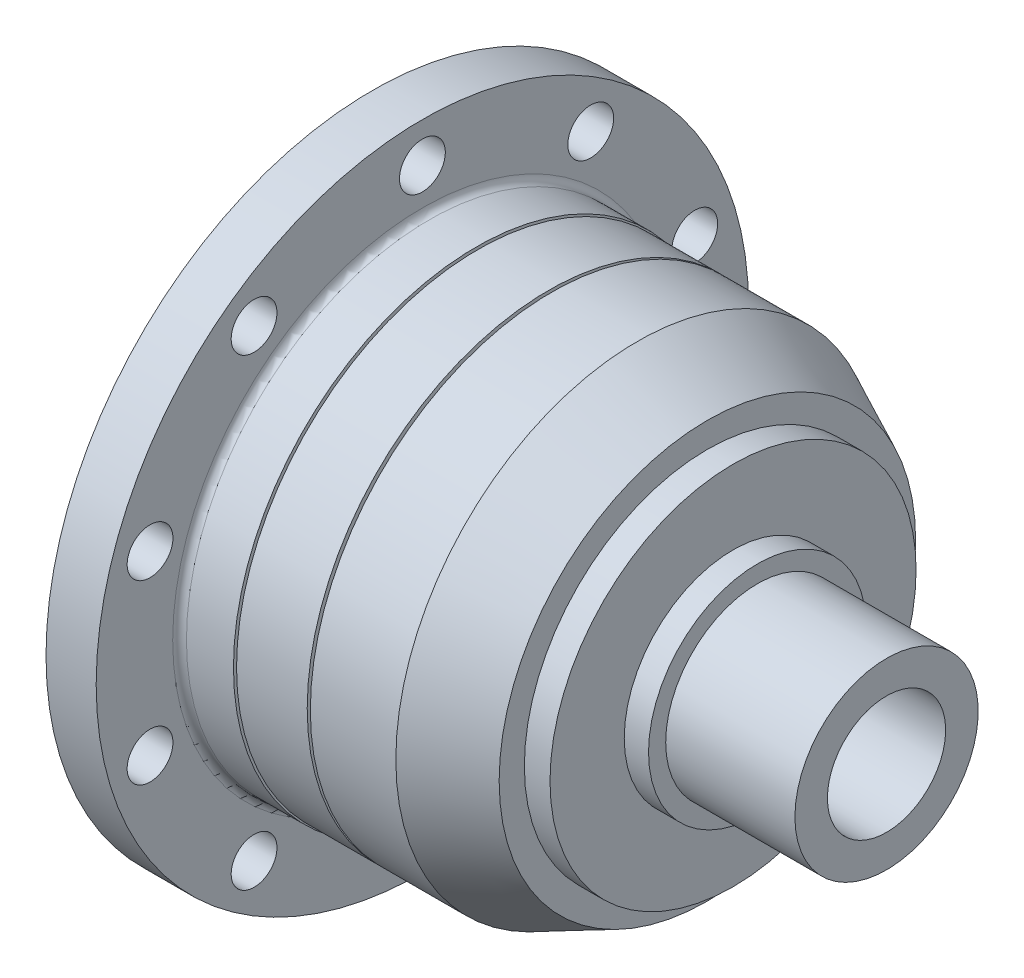
ISO-10303-21;
HEADER;
FILE_DESCRIPTION(('STEP AP214'),'2;1');
FILE_NAME('part.step','',(''),(''),'','','');
FILE_SCHEMA(('AUTOMOTIVE_DESIGN { 1 0 10303 214 1 1 1 1 }'));
ENDSEC;
DATA;
#1=APPLICATION_CONTEXT('core data for automotive mechanical design processes');
#2=APPLICATION_PROTOCOL_DEFINITION('international standard','automotive_design',2000,#1);
#3=PRODUCT_CONTEXT('',#1,'mechanical');
#4=PRODUCT('Part','Part','',(#3));
#5=PRODUCT_RELATED_PRODUCT_CATEGORY('part','',(#4));
#6=PRODUCT_DEFINITION_FORMATION('','',#4);
#7=PRODUCT_DEFINITION_CONTEXT('part definition',#1,'design');
#8=PRODUCT_DEFINITION('design','',#6,#7);
#9=PRODUCT_DEFINITION_SHAPE('','',#8);
#10=(LENGTH_UNIT() NAMED_UNIT(*) SI_UNIT(.MILLI.,.METRE.));
#11=(NAMED_UNIT(*) PLANE_ANGLE_UNIT() SI_UNIT($,.RADIAN.));
#12=(NAMED_UNIT(*) SI_UNIT($,.STERADIAN.) SOLID_ANGLE_UNIT());
#13=UNCERTAINTY_MEASURE_WITH_UNIT(LENGTH_MEASURE(1.E-05),#10,'distance_accuracy_value','');
#14=(GEOMETRIC_REPRESENTATION_CONTEXT(3) GLOBAL_UNCERTAINTY_ASSIGNED_CONTEXT((#13)) GLOBAL_UNIT_ASSIGNED_CONTEXT((#10,
#11,#12)) REPRESENTATION_CONTEXT('',''));
#15=CARTESIAN_POINT('',(0.,0.,0.));
#16=DIRECTION('',(0.,0.,1.));
#17=DIRECTION('',(1.,0.,0.));
#18=AXIS2_PLACEMENT_3D('',#15,#16,#17);
#19=CARTESIAN_POINT('',(-78.8432451274351,0.,0.));
#20=DIRECTION('',(-1.,0.,0.));
#21=DIRECTION('',(0.,0.,1.));
#22=AXIS2_PLACEMENT_3D('',#19,#20,#21);
#23=CYLINDRICAL_SURFACE('',#22,53.);
#24=CARTESIAN_POINT('',(1.5,0.,0.));
#25=DIRECTION('',(-1.,0.,0.));
#26=DIRECTION('',(0.,0.,1.));
#27=AXIS2_PLACEMENT_3D('',#24,#25,#26);
#28=CIRCLE('',#27,53.);
#29=CARTESIAN_POINT('',(1.5,0.,53.));
#30=VERTEX_POINT('',#29);
#31=EDGE_CURVE('E10',#30,#30,#28,.F.);
#32=ORIENTED_EDGE('',*,*,#31,.T.);
#33=EDGE_LOOP('',(#32));
#34=FACE_BOUND('',#33,.T.);
#35=CARTESIAN_POINT('',(11.7610377638337,0.,0.));
#36=DIRECTION('',(-1.,0.,0.));
#37=DIRECTION('',(0.,0.,1.));
#38=AXIS2_PLACEMENT_3D('',#35,#36,#37);
#39=CIRCLE('',#38,53.);
#40=CARTESIAN_POINT('',(11.7610377638337,0.,53.));
#41=VERTEX_POINT('',#40);
#42=EDGE_CURVE('E55',#41,#41,#39,.T.);
#43=ORIENTED_EDGE('',*,*,#42,.T.);
#44=EDGE_LOOP('',(#43));
#45=FACE_BOUND('',#44,.T.);
#46=ADVANCED_FACE('F35',(#34,#45),#23,.T.);
#47=CARTESIAN_POINT('',(11.7610377638337,53.,0.));
#48=DIRECTION('',(-1.,0.,0.));
#49=DIRECTION('',(0.,0.,1.));
#50=AXIS2_PLACEMENT_3D('',#47,#48,#49);
#51=PLANE('',#50);
#52=ORIENTED_EDGE('',*,*,#42,.F.);
#53=EDGE_LOOP('',(#52));
#54=FACE_BOUND('',#53,.T.);
#55=CARTESIAN_POINT('',(11.7610377638337,0.,0.));
#56=DIRECTION('',(-1.,0.,0.));
#57=DIRECTION('',(0.,0.,1.));
#58=AXIS2_PLACEMENT_3D('',#55,#56,#57);
#59=CIRCLE('',#58,50.1225899574681);
#60=CARTESIAN_POINT('',(11.7610377638337,0.,50.1225899574681));
#61=VERTEX_POINT('',#60);
#62=EDGE_CURVE('E58',#61,#61,#59,.T.);
#63=ORIENTED_EDGE('',*,*,#62,.T.);
#64=EDGE_LOOP('',(#63));
#65=FACE_BOUND('',#64,.T.);
#66=ADVANCED_FACE('F231',(#54,#65),#51,.F.);
#67=CARTESIAN_POINT('',(-78.8432451274351,0.,0.));
#68=DIRECTION('',(-1.,0.,0.));
#69=DIRECTION('',(0.,0.,1.));
#70=AXIS2_PLACEMENT_3D('',#67,#68,#69);
#71=CYLINDRICAL_SURFACE('',#70,50.1225899574681);
#72=ORIENTED_EDGE('',*,*,#62,.F.);
#73=EDGE_LOOP('',(#72));
#74=FACE_BOUND('',#73,.T.);
#75=CARTESIAN_POINT('',(12.1319098353485,0.,0.));
#76=DIRECTION('',(-1.,0.,0.));
#77=DIRECTION('',(0.,0.,1.));
#78=AXIS2_PLACEMENT_3D('',#75,#76,#77);
#79=CIRCLE('',#78,50.1225899574681);
#80=CARTESIAN_POINT('',(12.1319098353485,0.,50.1225899574681));
#81=VERTEX_POINT('',#80);
#82=EDGE_CURVE('E61',#81,#81,#79,.T.);
#83=ORIENTED_EDGE('',*,*,#82,.T.);
#84=EDGE_LOOP('',(#83));
#85=FACE_BOUND('',#84,.T.);
#86=ADVANCED_FACE('F236',(#74,#85),#71,.T.);
#87=CARTESIAN_POINT('',(12.1319098353485,50.1225899574681,0.));
#88=DIRECTION('',(1.,0.,0.));
#89=DIRECTION('',(0.,0.,-1.));
#90=AXIS2_PLACEMENT_3D('',#87,#88,#89);
#91=PLANE('',#90);
#92=ORIENTED_EDGE('',*,*,#82,.F.);
#93=EDGE_LOOP('',(#92));
#94=FACE_BOUND('',#93,.T.);
#95=CARTESIAN_POINT('',(12.1319098353485,0.,0.));
#96=DIRECTION('',(-1.,0.,0.));
#97=DIRECTION('',(0.,0.,1.));
#98=AXIS2_PLACEMENT_3D('',#95,#96,#97);
#99=CIRCLE('',#98,52.7);
#100=CARTESIAN_POINT('',(12.1319098353485,0.,52.7));
#101=VERTEX_POINT('',#100);
#102=EDGE_CURVE('E64',#101,#101,#99,.T.);
#103=ORIENTED_EDGE('',*,*,#102,.T.);
#104=EDGE_LOOP('',(#103));
#105=FACE_BOUND('',#104,.T.);
#106=ADVANCED_FACE('F332',(#94,#105),#91,.F.);
#107=CARTESIAN_POINT('',(-78.8432451274351,0.,0.));
#108=DIRECTION('',(-1.,0.,0.));
#109=DIRECTION('',(0.,0.,1.));
#110=AXIS2_PLACEMENT_3D('',#107,#108,#109);
#111=CYLINDRICAL_SURFACE('',#110,52.7);
#112=ORIENTED_EDGE('',*,*,#102,.F.);
#113=EDGE_LOOP('',(#112));
#114=FACE_BOUND('',#113,.T.);
#115=CARTESIAN_POINT('',(27.559120447787,0.,0.));
#116=DIRECTION('',(-1.,0.,0.));
#117=DIRECTION('',(0.,0.,1.));
#118=AXIS2_PLACEMENT_3D('',#115,#116,#117);
#119=CIRCLE('',#118,52.7);
#120=CARTESIAN_POINT('',(27.559120447787,0.,52.7));
#121=VERTEX_POINT('',#120);
#122=EDGE_CURVE('E67',#121,#121,#119,.T.);
#123=ORIENTED_EDGE('',*,*,#122,.T.);
#124=EDGE_LOOP('',(#123));
#125=FACE_BOUND('',#124,.T.);
#126=ADVANCED_FACE('F328',(#114,#125),#111,.T.);
#127=CARTESIAN_POINT('',(27.559120447787,52.7,0.));
#128=DIRECTION('',(-1.,0.,0.));
#129=DIRECTION('',(0.,0.,1.));
#130=AXIS2_PLACEMENT_3D('',#127,#128,#129);
#131=PLANE('',#130);
#132=ORIENTED_EDGE('',*,*,#122,.F.);
#133=EDGE_LOOP('',(#132));
#134=FACE_BOUND('',#133,.T.);
#135=CARTESIAN_POINT('',(27.559120447787,0.,0.));
#136=DIRECTION('',(-1.,0.,0.));
#137=DIRECTION('',(0.,0.,1.));
#138=AXIS2_PLACEMENT_3D('',#135,#136,#137);
#139=CIRCLE('',#138,51.3492590979716);
#140=CARTESIAN_POINT('',(27.559120447787,0.,51.3492590979716));
#141=VERTEX_POINT('',#140);
#142=EDGE_CURVE('E70',#141,#141,#139,.T.);
#143=ORIENTED_EDGE('',*,*,#142,.T.);
#144=EDGE_LOOP('',(#143));
#145=FACE_BOUND('',#144,.T.);
#146=ADVANCED_FACE('F324',(#134,#145),#131,.F.);
#147=CARTESIAN_POINT('',(-78.8432451274351,0.,0.));
#148=DIRECTION('',(-1.,0.,0.));
#149=DIRECTION('',(0.,0.,1.));
#150=AXIS2_PLACEMENT_3D('',#147,#148,#149);
#151=CYLINDRICAL_SURFACE('',#150,51.3492590979716);
#152=ORIENTED_EDGE('',*,*,#142,.F.);
#153=EDGE_LOOP('',(#152));
#154=FACE_BOUND('',#153,.T.);
#155=CARTESIAN_POINT('',(28.2404045519705,0.,0.));
#156=DIRECTION('',(-1.,0.,0.));
#157=DIRECTION('',(0.,0.,1.));
#158=AXIS2_PLACEMENT_3D('',#155,#156,#157);
#159=CIRCLE('',#158,51.3492590979716);
#160=CARTESIAN_POINT('',(28.2404045519705,0.,51.3492590979716));
#161=VERTEX_POINT('',#160);
#162=EDGE_CURVE('E73',#161,#161,#159,.T.);
#163=ORIENTED_EDGE('',*,*,#162,.T.);
#164=EDGE_LOOP('',(#163));
#165=FACE_BOUND('',#164,.T.);
#166=ADVANCED_FACE('F320',(#154,#165),#151,.T.);
#167=CARTESIAN_POINT('',(28.2404045519705,51.3492590979716,0.));
#168=DIRECTION('',(1.,0.,0.));
#169=DIRECTION('',(0.,0.,-1.));
#170=AXIS2_PLACEMENT_3D('',#167,#168,#169);
#171=PLANE('',#170);
#172=ORIENTED_EDGE('',*,*,#162,.F.);
#173=EDGE_LOOP('',(#172));
#174=FACE_BOUND('',#173,.T.);
#175=CARTESIAN_POINT('',(28.2404045519705,0.,0.));
#176=DIRECTION('',(-1.,0.,0.));
#177=DIRECTION('',(0.,0.,1.));
#178=AXIS2_PLACEMENT_3D('',#175,#176,#177);
#179=CIRCLE('',#178,52.7);
#180=CARTESIAN_POINT('',(28.2404045519705,0.,52.7));
#181=VERTEX_POINT('',#180);
#182=EDGE_CURVE('E76',#181,#181,#179,.T.);
#183=ORIENTED_EDGE('',*,*,#182,.T.);
#184=EDGE_LOOP('',(#183));
#185=FACE_BOUND('',#184,.T.);
#186=ADVANCED_FACE('F316',(#174,#185),#171,.F.);
#187=CARTESIAN_POINT('',(-78.8432451274351,0.,0.));
#188=DIRECTION('',(-1.,0.,0.));
#189=DIRECTION('',(0.,0.,1.));
#190=AXIS2_PLACEMENT_3D('',#187,#188,#189);
#191=CYLINDRICAL_SURFACE('',#190,52.7);
#192=ORIENTED_EDGE('',*,*,#182,.F.);
#193=EDGE_LOOP('',(#192));
#194=FACE_BOUND('',#193,.T.);
#195=CARTESIAN_POINT('',(46.9,0.,0.));
#196=DIRECTION('',(-1.,0.,0.));
#197=DIRECTION('',(0.,0.,1.));
#198=AXIS2_PLACEMENT_3D('',#195,#196,#197);
#199=CIRCLE('',#198,52.7);
#200=CARTESIAN_POINT('',(46.9,0.,52.7));
#201=VERTEX_POINT('',#200);
#202=EDGE_CURVE('E79',#201,#201,#199,.T.);
#203=ORIENTED_EDGE('',*,*,#202,.T.);
#204=EDGE_LOOP('',(#203));
#205=FACE_BOUND('',#204,.T.);
#206=ADVANCED_FACE('F312',(#194,#205),#191,.T.);
#207=CARTESIAN_POINT('',(62.2,0.,0.));
#208=DIRECTION('',(-1.,0.,0.));
#209=DIRECTION('',(0.,0.,1.));
#210=AXIS2_PLACEMENT_3D('',#207,#208,#209);
#211=CONICAL_SURFACE('',#210,45.45,0.442514692142839);
#212=ORIENTED_EDGE('',*,*,#202,.F.);
#213=EDGE_LOOP('',(#212));
#214=FACE_BOUND('',#213,.T.);
#215=CARTESIAN_POINT('',(62.2,0.,0.));
#216=DIRECTION('',(-1.,0.,0.));
#217=DIRECTION('',(0.,0.,1.));
#218=AXIS2_PLACEMENT_3D('',#215,#216,#217);
#219=CIRCLE('',#218,45.45);
#220=CARTESIAN_POINT('',(62.2,0.,45.45));
#221=VERTEX_POINT('',#220);
#222=EDGE_CURVE('E82',#221,#221,#219,.T.);
#223=ORIENTED_EDGE('',*,*,#222,.T.);
#224=EDGE_LOOP('',(#223));
#225=FACE_BOUND('',#224,.T.);
#226=ADVANCED_FACE('F308',(#214,#225),#211,.T.);
#227=CARTESIAN_POINT('',(62.2,45.45,0.));
#228=DIRECTION('',(-1.,0.,0.));
#229=DIRECTION('',(0.,0.,1.));
#230=AXIS2_PLACEMENT_3D('',#227,#228,#229);
#231=PLANE('',#230);
#232=ORIENTED_EDGE('',*,*,#222,.F.);
#233=EDGE_LOOP('',(#232));
#234=FACE_BOUND('',#233,.T.);
#235=CARTESIAN_POINT('',(62.2,0.,0.));
#236=DIRECTION('',(-1.,0.,0.));
#237=DIRECTION('',(0.,0.,1.));
#238=AXIS2_PLACEMENT_3D('',#235,#236,#237);
#239=CIRCLE('',#238,39.95);
#240=CARTESIAN_POINT('',(62.2,0.,39.95));
#241=VERTEX_POINT('',#240);
#242=EDGE_CURVE('E85',#241,#241,#239,.T.);
#243=ORIENTED_EDGE('',*,*,#242,.T.);
#244=EDGE_LOOP('',(#243));
#245=FACE_BOUND('',#244,.T.);
#246=ADVANCED_FACE('F304',(#234,#245),#231,.F.);
#247=CARTESIAN_POINT('',(-78.8432451274351,0.,0.));
#248=DIRECTION('',(-1.,0.,0.));
#249=DIRECTION('',(0.,0.,1.));
#250=AXIS2_PLACEMENT_3D('',#247,#248,#249);
#251=CYLINDRICAL_SURFACE('',#250,39.95);
#252=ORIENTED_EDGE('',*,*,#242,.F.);
#253=EDGE_LOOP('',(#252));
#254=FACE_BOUND('',#253,.T.);
#255=CARTESIAN_POINT('',(67.8,0.,0.));
#256=DIRECTION('',(-1.,0.,0.));
#257=DIRECTION('',(0.,0.,1.));
#258=AXIS2_PLACEMENT_3D('',#255,#256,#257);
#259=CIRCLE('',#258,39.95);
#260=CARTESIAN_POINT('',(67.8,0.,39.95));
#261=VERTEX_POINT('',#260);
#262=EDGE_CURVE('E88',#261,#261,#259,.T.);
#263=ORIENTED_EDGE('',*,*,#262,.T.);
#264=EDGE_LOOP('',(#263));
#265=FACE_BOUND('',#264,.T.);
#266=ADVANCED_FACE('F300',(#254,#265),#251,.T.);
#267=CARTESIAN_POINT('',(67.8,39.95,0.));
#268=DIRECTION('',(-1.,0.,0.));
#269=DIRECTION('',(0.,0.,1.));
#270=AXIS2_PLACEMENT_3D('',#267,#268,#269);
#271=PLANE('',#270);
#272=ORIENTED_EDGE('',*,*,#262,.F.);
#273=EDGE_LOOP('',(#272));
#274=FACE_BOUND('',#273,.T.);
#275=CARTESIAN_POINT('',(67.8,0.,0.));
#276=DIRECTION('',(-1.,0.,0.));
#277=DIRECTION('',(0.,0.,1.));
#278=AXIS2_PLACEMENT_3D('',#275,#276,#277);
#279=CIRCLE('',#278,23.75);
#280=CARTESIAN_POINT('',(67.8,0.,23.75));
#281=VERTEX_POINT('',#280);
#282=EDGE_CURVE('E91',#281,#281,#279,.T.);
#283=ORIENTED_EDGE('',*,*,#282,.T.);
#284=EDGE_LOOP('',(#283));
#285=FACE_BOUND('',#284,.T.);
#286=ADVANCED_FACE('F296',(#274,#285),#271,.F.);
#287=CARTESIAN_POINT('',(-78.8432451274351,0.,0.));
#288=DIRECTION('',(-1.,0.,0.));
#289=DIRECTION('',(0.,0.,1.));
#290=AXIS2_PLACEMENT_3D('',#287,#288,#289);
#291=CYLINDRICAL_SURFACE('',#290,23.75);
#292=ORIENTED_EDGE('',*,*,#282,.F.);
#293=EDGE_LOOP('',(#292));
#294=FACE_BOUND('',#293,.T.);
#295=CARTESIAN_POINT('',(73.1,0.,0.));
#296=DIRECTION('',(-1.,0.,0.));
#297=DIRECTION('',(0.,0.,1.));
#298=AXIS2_PLACEMENT_3D('',#295,#296,#297);
#299=CIRCLE('',#298,23.75);
#300=CARTESIAN_POINT('',(73.1,0.,23.75));
#301=VERTEX_POINT('',#300);
#302=EDGE_CURVE('E94',#301,#301,#299,.T.);
#303=ORIENTED_EDGE('',*,*,#302,.T.);
#304=EDGE_LOOP('',(#303));
#305=FACE_BOUND('',#304,.T.);
#306=ADVANCED_FACE('F292',(#294,#305),#291,.T.);
#307=CARTESIAN_POINT('',(73.1,23.75,0.));
#308=DIRECTION('',(-1.,0.,0.));
#309=DIRECTION('',(0.,0.,1.));
#310=AXIS2_PLACEMENT_3D('',#307,#308,#309);
#311=PLANE('',#310);
#312=ORIENTED_EDGE('',*,*,#302,.F.);
#313=EDGE_LOOP('',(#312));
#314=FACE_BOUND('',#313,.T.);
#315=CARTESIAN_POINT('',(73.1,0.,0.));
#316=DIRECTION('',(-1.,0.,0.));
#317=DIRECTION('',(0.,0.,1.));
#318=AXIS2_PLACEMENT_3D('',#315,#316,#317);
#319=CIRCLE('',#318,20.);
#320=CARTESIAN_POINT('',(73.1,0.,20.));
#321=VERTEX_POINT('',#320);
#322=EDGE_CURVE('E97',#321,#321,#319,.T.);
#323=ORIENTED_EDGE('',*,*,#322,.T.);
#324=EDGE_LOOP('',(#323));
#325=FACE_BOUND('',#324,.T.);
#326=ADVANCED_FACE('F288',(#314,#325),#311,.F.);
#327=CARTESIAN_POINT('',(-78.8432451274351,0.,0.));
#328=DIRECTION('',(-1.,0.,0.));
#329=DIRECTION('',(0.,0.,1.));
#330=AXIS2_PLACEMENT_3D('',#327,#328,#329);
#331=CYLINDRICAL_SURFACE('',#330,20.);
#332=ORIENTED_EDGE('',*,*,#322,.F.);
#333=EDGE_LOOP('',(#332));
#334=FACE_BOUND('',#333,.T.);
#335=CARTESIAN_POINT('',(101.3,0.,0.));
#336=DIRECTION('',(-1.,0.,0.));
#337=DIRECTION('',(0.,0.,1.));
#338=AXIS2_PLACEMENT_3D('',#335,#336,#337);
#339=CIRCLE('',#338,20.);
#340=CARTESIAN_POINT('',(101.3,0.,20.));
#341=VERTEX_POINT('',#340);
#342=EDGE_CURVE('E100',#341,#341,#339,.T.);
#343=ORIENTED_EDGE('',*,*,#342,.T.);
#344=EDGE_LOOP('',(#343));
#345=FACE_BOUND('',#344,.T.);
#346=ADVANCED_FACE('F284',(#334,#345),#331,.T.);
#347=CARTESIAN_POINT('',(101.3,20.,0.));
#348=DIRECTION('',(-1.,0.,0.));
#349=DIRECTION('',(0.,0.,1.));
#350=AXIS2_PLACEMENT_3D('',#347,#348,#349);
#351=PLANE('',#350);
#352=ORIENTED_EDGE('',*,*,#342,.F.);
#353=EDGE_LOOP('',(#352));
#354=FACE_BOUND('',#353,.T.);
#355=CARTESIAN_POINT('',(101.3,0.,0.));
#356=DIRECTION('',(-1.,0.,0.));
#357=DIRECTION('',(0.,0.,1.));
#358=AXIS2_PLACEMENT_3D('',#355,#356,#357);
#359=CIRCLE('',#358,12.9);
#360=CARTESIAN_POINT('',(101.3,0.,12.9));
#361=VERTEX_POINT('',#360);
#362=EDGE_CURVE('E103',#361,#361,#359,.T.);
#363=ORIENTED_EDGE('',*,*,#362,.T.);
#364=EDGE_LOOP('',(#363));
#365=FACE_BOUND('',#364,.T.);
#366=ADVANCED_FACE('F280',(#354,#365),#351,.F.);
#367=CARTESIAN_POINT('',(-78.8432451274351,0.,0.));
#368=DIRECTION('',(-1.,0.,0.));
#369=DIRECTION('',(0.,0.,1.));
#370=AXIS2_PLACEMENT_3D('',#367,#368,#369);
#371=CYLINDRICAL_SURFACE('',#370,12.9);
#372=ORIENTED_EDGE('',*,*,#362,.F.);
#373=EDGE_LOOP('',(#372));
#374=FACE_BOUND('',#373,.T.);
#375=CARTESIAN_POINT('',(-34.5,0.,0.));
#376=DIRECTION('',(-1.,0.,0.));
#377=DIRECTION('',(0.,0.,1.));
#378=AXIS2_PLACEMENT_3D('',#375,#376,#377);
#379=CIRCLE('',#378,12.9);
#380=CARTESIAN_POINT('',(-34.5,0.,12.9));
#381=VERTEX_POINT('',#380);
#382=EDGE_CURVE('E106',#381,#381,#379,.T.);
#383=ORIENTED_EDGE('',*,*,#382,.T.);
#384=EDGE_LOOP('',(#383));
#385=FACE_BOUND('',#384,.T.);
#386=ADVANCED_FACE('F276',(#374,#385),#371,.F.);
#387=CARTESIAN_POINT('',(-34.5,20.,0.));
#388=DIRECTION('',(1.,0.,0.));
#389=DIRECTION('',(0.,0.,-1.));
#390=AXIS2_PLACEMENT_3D('',#387,#388,#389);
#391=PLANE('',#390);
#392=ORIENTED_EDGE('',*,*,#382,.F.);
#393=EDGE_LOOP('',(#392));
#394=FACE_BOUND('',#393,.T.);
#395=CARTESIAN_POINT('',(-34.5,0.,0.));
#396=DIRECTION('',(-1.,0.,0.));
#397=DIRECTION('',(0.,0.,1.));
#398=AXIS2_PLACEMENT_3D('',#395,#396,#397);
#399=CIRCLE('',#398,20.);
#400=CARTESIAN_POINT('',(-34.5,0.,20.));
#401=VERTEX_POINT('',#400);
#402=EDGE_CURVE('E109',#401,#401,#399,.T.);
#403=ORIENTED_EDGE('',*,*,#402,.T.);
#404=EDGE_LOOP('',(#403));
#405=FACE_BOUND('',#404,.T.);
#406=ADVANCED_FACE('F269',(#394,#405),#391,.F.);
#407=CARTESIAN_POINT('',(-78.8432451274351,0.,0.));
#408=DIRECTION('',(-1.,0.,0.));
#409=DIRECTION('',(0.,0.,1.));
#410=AXIS2_PLACEMENT_3D('',#407,#408,#409);
#411=CYLINDRICAL_SURFACE('',#410,20.);
#412=ORIENTED_EDGE('',*,*,#402,.F.);
#413=EDGE_LOOP('',(#412));
#414=FACE_BOUND('',#413,.T.);
#415=CARTESIAN_POINT('',(-12.95,0.,0.));
#416=DIRECTION('',(-1.,0.,0.));
#417=DIRECTION('',(0.,0.,1.));
#418=AXIS2_PLACEMENT_3D('',#415,#416,#417);
#419=CIRCLE('',#418,20.);
#420=CARTESIAN_POINT('',(-12.95,0.,20.));
#421=VERTEX_POINT('',#420);
#422=EDGE_CURVE('E112',#421,#421,#419,.T.);
#423=ORIENTED_EDGE('',*,*,#422,.T.);
#424=EDGE_LOOP('',(#423));
#425=FACE_BOUND('',#424,.T.);
#426=ADVANCED_FACE('F263',(#414,#425),#411,.T.);
#427=CARTESIAN_POINT('',(-12.95,24.85,0.));
#428=DIRECTION('',(1.,0.,0.));
#429=DIRECTION('',(0.,0.,-1.));
#430=AXIS2_PLACEMENT_3D('',#427,#428,#429);
#431=PLANE('',#430);
#432=ORIENTED_EDGE('',*,*,#422,.F.);
#433=EDGE_LOOP('',(#432));
#434=FACE_BOUND('',#433,.T.);
#435=CARTESIAN_POINT('',(-12.95,0.,0.));
#436=DIRECTION('',(-1.,0.,0.));
#437=DIRECTION('',(0.,0.,1.));
#438=AXIS2_PLACEMENT_3D('',#435,#436,#437);
#439=CIRCLE('',#438,24.85);
#440=CARTESIAN_POINT('',(-12.95,0.,24.85));
#441=VERTEX_POINT('',#440);
#442=EDGE_CURVE('E115',#441,#441,#439,.T.);
#443=ORIENTED_EDGE('',*,*,#442,.T.);
#444=EDGE_LOOP('',(#443));
#445=FACE_BOUND('',#444,.T.);
#446=ADVANCED_FACE('F258',(#434,#445),#431,.F.);
#447=CARTESIAN_POINT('',(-78.8432451274351,0.,0.));
#448=DIRECTION('',(-1.,0.,0.));
#449=DIRECTION('',(0.,0.,1.));
#450=AXIS2_PLACEMENT_3D('',#447,#448,#449);
#451=CYLINDRICAL_SURFACE('',#450,24.85);
#452=CARTESIAN_POINT('',(-12.45,0.,0.));
#453=DIRECTION('',(1.,0.,0.));
#454=DIRECTION('',(0.,0.,-1.));
#455=AXIS2_PLACEMENT_3D('',#452,#453,#454);
#456=CIRCLE('',#455,24.85);
#457=CARTESIAN_POINT('',(-12.45,0.,-24.85));
#458=VERTEX_POINT('',#457);
#459=EDGE_CURVE('E50',#458,#458,#456,.F.);
#460=ORIENTED_EDGE('',*,*,#459,.T.);
#461=EDGE_LOOP('',(#460));
#462=FACE_BOUND('',#461,.T.);
#463=ORIENTED_EDGE('',*,*,#442,.F.);
#464=EDGE_LOOP('',(#463));
#465=FACE_BOUND('',#464,.T.);
#466=ADVANCED_FACE('F191',(#462,#465),#451,.T.);
#467=CARTESIAN_POINT('',(-10.95,71.2,0.));
#468=DIRECTION('',(1.,0.,0.));
#469=DIRECTION('',(0.,0.,-1.));
#470=AXIS2_PLACEMENT_3D('',#467,#468,#469);
#471=PLANE('',#470);
#472=CARTESIAN_POINT('',(-10.95,0.,0.));
#473=DIRECTION('',(1.,0.,0.));
#474=DIRECTION('',(0.,0.,-1.));
#475=AXIS2_PLACEMENT_3D('',#472,#473,#474);
#476=CIRCLE('',#475,26.35);
#477=CARTESIAN_POINT('',(-10.95,0.,-26.35));
#478=VERTEX_POINT('',#477);
#479=EDGE_CURVE('E46',#478,#478,#476,.T.);
#480=ORIENTED_EDGE('',*,*,#479,.T.);
#481=EDGE_LOOP('',(#480));
#482=FACE_BOUND('',#481,.T.);
#483=CARTESIAN_POINT('',(-10.95,50.5635621484347,-36.7365782682789));
#484=DIRECTION('',(-1.,0.,0.));
#485=DIRECTION('',(0.,0.,1.));
#486=AXIS2_PLACEMENT_3D('',#483,#484,#485);
#487=CIRCLE('',#486,5.);
#488=CARTESIAN_POINT('',(-10.95,50.5635621484347,-31.7365782682789));
#489=VERTEX_POINT('',#488);
#490=EDGE_CURVE('E181',#489,#489,#487,.T.);
#491=ORIENTED_EDGE('',*,*,#490,.F.);
#492=EDGE_LOOP('',(#491));
#493=FACE_BOUND('',#492,.T.);
#494=CARTESIAN_POINT('',(-10.95,19.3135621484349,-59.4410322684469));
#495=DIRECTION('',(-1.,0.,0.));
#496=DIRECTION('',(0.,0.,1.));
#497=AXIS2_PLACEMENT_3D('',#494,#495,#496);
#498=CIRCLE('',#497,5.);
#499=CARTESIAN_POINT('',(-10.95,19.3135621484349,-54.4410322684469));
#500=VERTEX_POINT('',#499);
#501=EDGE_CURVE('E175',#500,#500,#498,.T.);
#502=ORIENTED_EDGE('',*,*,#501,.F.);
#503=EDGE_LOOP('',(#502));
#504=FACE_BOUND('',#503,.T.);
#505=CARTESIAN_POINT('',(-10.95,-19.3135621484336,-59.4410322684473));
#506=DIRECTION('',(-1.,0.,0.));
#507=DIRECTION('',(0.,0.,1.));
#508=AXIS2_PLACEMENT_3D('',#505,#506,#507);
#509=CIRCLE('',#508,5.00000000000001);
#510=CARTESIAN_POINT('',(-10.95,-19.3135621484336,-54.4410322684473));
#511=VERTEX_POINT('',#510);
#512=EDGE_CURVE('E169',#511,#511,#509,.T.);
#513=ORIENTED_EDGE('',*,*,#512,.F.);
#514=EDGE_LOOP('',(#513));
#515=FACE_BOUND('',#514,.T.);
#516=CARTESIAN_POINT('',(-10.95,-50.5635621484339,-36.73657826828));
#517=DIRECTION('',(-1.,0.,0.));
#518=DIRECTION('',(0.,0.,1.));
#519=AXIS2_PLACEMENT_3D('',#516,#517,#518);
#520=CIRCLE('',#519,5.);
#521=CARTESIAN_POINT('',(-10.95,-50.5635621484339,-31.73657826828));
#522=VERTEX_POINT('',#521);
#523=EDGE_CURVE('E163',#522,#522,#520,.T.);
#524=ORIENTED_EDGE('',*,*,#523,.F.);
#525=EDGE_LOOP('',(#524));
#526=FACE_BOUND('',#525,.T.);
#527=CARTESIAN_POINT('',(-10.95,-62.5,-4.36435167355392E-13));
#528=DIRECTION('',(-1.,0.,0.));
#529=DIRECTION('',(0.,0.,1.));
#530=AXIS2_PLACEMENT_3D('',#527,#528,#529);
#531=CIRCLE('',#530,5.);
#532=CARTESIAN_POINT('',(-10.95,-62.5,4.99999999999957));
#533=VERTEX_POINT('',#532);
#534=EDGE_CURVE('E157',#533,#533,#531,.T.);
#535=ORIENTED_EDGE('',*,*,#534,.F.);
#536=EDGE_LOOP('',(#535));
#537=FACE_BOUND('',#536,.T.);
#538=CARTESIAN_POINT('',(-10.95,-50.5635621484344,36.7365782682793));
#539=DIRECTION('',(-1.,0.,0.));
#540=DIRECTION('',(0.,0.,1.));
#541=AXIS2_PLACEMENT_3D('',#538,#539,#540);
#542=CIRCLE('',#541,5.);
#543=CARTESIAN_POINT('',(-10.95,-50.5635621484344,41.7365782682793));
#544=VERTEX_POINT('',#543);
#545=EDGE_CURVE('E151',#544,#544,#542,.T.);
#546=ORIENTED_EDGE('',*,*,#545,.F.);
#547=EDGE_LOOP('',(#546));
#548=FACE_BOUND('',#547,.T.);
#549=CARTESIAN_POINT('',(-10.95,-19.3135621484345,59.441032268447));
#550=DIRECTION('',(-1.,0.,0.));
#551=DIRECTION('',(0.,0.,1.));
#552=AXIS2_PLACEMENT_3D('',#549,#550,#551);
#553=CIRCLE('',#552,5.);
#554=CARTESIAN_POINT('',(-10.95,-19.3135621484345,64.441032268447));
#555=VERTEX_POINT('',#554);
#556=EDGE_CURVE('E145',#555,#555,#553,.T.);
#557=ORIENTED_EDGE('',*,*,#556,.F.);
#558=EDGE_LOOP('',(#557));
#559=FACE_BOUND('',#558,.T.);
#560=CARTESIAN_POINT('',(-10.95,19.313562148434,59.4410322684472));
#561=DIRECTION('',(-1.,0.,0.));
#562=DIRECTION('',(0.,0.,1.));
#563=AXIS2_PLACEMENT_3D('',#560,#561,#562);
#564=CIRCLE('',#563,5.);
#565=CARTESIAN_POINT('',(-10.95,19.313562148434,64.4410322684472));
#566=VERTEX_POINT('',#565);
#567=EDGE_CURVE('E139',#566,#566,#564,.T.);
#568=ORIENTED_EDGE('',*,*,#567,.F.);
#569=EDGE_LOOP('',(#568));
#570=FACE_BOUND('',#569,.T.);
#571=CARTESIAN_POINT('',(-10.95,50.5635621484342,36.7365782682797));
#572=DIRECTION('',(-1.,0.,0.));
#573=DIRECTION('',(0.,0.,1.));
#574=AXIS2_PLACEMENT_3D('',#571,#572,#573);
#575=CIRCLE('',#574,5.00000000000001);
#576=CARTESIAN_POINT('',(-10.95,50.5635621484342,41.7365782682797));
#577=VERTEX_POINT('',#576);
#578=EDGE_CURVE('E133',#577,#577,#575,.T.);
#579=ORIENTED_EDGE('',*,*,#578,.F.);
#580=EDGE_LOOP('',(#579));
#581=FACE_BOUND('',#580,.T.);
#582=CARTESIAN_POINT('',(-10.95,62.5,0.));
#583=DIRECTION('',(-1.,0.,0.));
#584=DIRECTION('',(0.,0.,1.));
#585=AXIS2_PLACEMENT_3D('',#582,#583,#584);
#586=CIRCLE('',#585,5.);
#587=CARTESIAN_POINT('',(-10.95,62.5,5.));
#588=VERTEX_POINT('',#587);
#589=EDGE_CURVE('E127',#588,#588,#586,.T.);
#590=ORIENTED_EDGE('',*,*,#589,.F.);
#591=EDGE_LOOP('',(#590));
#592=FACE_BOUND('',#591,.T.);
#593=CARTESIAN_POINT('',(-10.95,0.,0.));
#594=DIRECTION('',(-1.,0.,0.));
#595=DIRECTION('',(0.,0.,1.));
#596=AXIS2_PLACEMENT_3D('',#593,#594,#595);
#597=CIRCLE('',#596,71.2);
#598=CARTESIAN_POINT('',(-10.95,0.,71.2));
#599=VERTEX_POINT('',#598);
#600=EDGE_CURVE('E118',#599,#599,#597,.T.);
#601=ORIENTED_EDGE('',*,*,#600,.T.);
#602=EDGE_LOOP('',(#601));
#603=FACE_BOUND('',#602,.T.);
#604=ADVANCED_FACE('F187',(#482,#493,#504,#515,#526,#537,#548,#559,#570,#581,#592,#603),#471,.F.);
#605=CARTESIAN_POINT('',(-78.8432451274351,0.,0.));
#606=DIRECTION('',(-1.,0.,0.));
#607=DIRECTION('',(0.,0.,1.));
#608=AXIS2_PLACEMENT_3D('',#605,#606,#607);
#609=CYLINDRICAL_SURFACE('',#608,71.2);
#610=ORIENTED_EDGE('',*,*,#600,.F.);
#611=EDGE_LOOP('',(#610));
#612=FACE_BOUND('',#611,.T.);
#613=CARTESIAN_POINT('',(0.,0.,0.));
#614=DIRECTION('',(-1.,0.,0.));
#615=DIRECTION('',(0.,0.,1.));
#616=AXIS2_PLACEMENT_3D('',#613,#614,#615);
#617=CIRCLE('',#616,71.2);
#618=CARTESIAN_POINT('',(0.,0.,71.2));
#619=VERTEX_POINT('',#618);
#620=EDGE_CURVE('E121',#619,#619,#617,.T.);
#621=ORIENTED_EDGE('',*,*,#620,.T.);
#622=EDGE_LOOP('',(#621));
#623=FACE_BOUND('',#622,.T.);
#624=ADVANCED_FACE('F190',(#612,#623),#609,.T.);
#625=CARTESIAN_POINT('',(0.,53.,0.));
#626=DIRECTION('',(-1.,0.,0.));
#627=DIRECTION('',(0.,0.,1.));
#628=AXIS2_PLACEMENT_3D('',#625,#626,#627);
#629=PLANE('',#628);
#630=CARTESIAN_POINT('',(0.,0.,0.));
#631=DIRECTION('',(-1.,0.,0.));
#632=DIRECTION('',(0.,0.,1.));
#633=AXIS2_PLACEMENT_3D('',#630,#631,#632);
#634=CIRCLE('',#633,54.5);
#635=CARTESIAN_POINT('',(0.,0.,54.5));
#636=VERTEX_POINT('',#635);
#637=EDGE_CURVE('E42',#636,#636,#634,.T.);
#638=ORIENTED_EDGE('',*,*,#637,.T.);
#639=EDGE_LOOP('',(#638));
#640=FACE_BOUND('',#639,.T.);
#641=CARTESIAN_POINT('',(0.,50.5635621484347,-36.7365782682789));
#642=DIRECTION('',(-1.,0.,0.));
#643=DIRECTION('',(0.,0.,1.));
#644=AXIS2_PLACEMENT_3D('',#641,#642,#643);
#645=CIRCLE('',#644,5.);
#646=CARTESIAN_POINT('',(0.,50.5635621484347,-31.7365782682789));
#647=VERTEX_POINT('',#646);
#648=EDGE_CURVE('E178',#647,#647,#645,.F.);
#649=ORIENTED_EDGE('',*,*,#648,.F.);
#650=EDGE_LOOP('',(#649));
#651=FACE_BOUND('',#650,.T.);
#652=CARTESIAN_POINT('',(0.,19.3135621484349,-59.4410322684469));
#653=DIRECTION('',(-1.,0.,0.));
#654=DIRECTION('',(0.,0.,1.));
#655=AXIS2_PLACEMENT_3D('',#652,#653,#654);
#656=CIRCLE('',#655,5.);
#657=CARTESIAN_POINT('',(0.,19.3135621484349,-54.4410322684469));
#658=VERTEX_POINT('',#657);
#659=EDGE_CURVE('E172',#658,#658,#656,.F.);
#660=ORIENTED_EDGE('',*,*,#659,.F.);
#661=EDGE_LOOP('',(#660));
#662=FACE_BOUND('',#661,.T.);
#663=CARTESIAN_POINT('',(0.,-19.3135621484336,-59.4410322684473));
#664=DIRECTION('',(-1.,0.,0.));
#665=DIRECTION('',(0.,0.,1.));
#666=AXIS2_PLACEMENT_3D('',#663,#664,#665);
#667=CIRCLE('',#666,5.00000000000001);
#668=CARTESIAN_POINT('',(0.,-19.3135621484336,-54.4410322684473));
#669=VERTEX_POINT('',#668);
#670=EDGE_CURVE('E166',#669,#669,#667,.F.);
#671=ORIENTED_EDGE('',*,*,#670,.F.);
#672=EDGE_LOOP('',(#671));
#673=FACE_BOUND('',#672,.T.);
#674=CARTESIAN_POINT('',(0.,-50.5635621484339,-36.73657826828));
#675=DIRECTION('',(-1.,0.,0.));
#676=DIRECTION('',(0.,0.,1.));
#677=AXIS2_PLACEMENT_3D('',#674,#675,#676);
#678=CIRCLE('',#677,5.);
#679=CARTESIAN_POINT('',(0.,-50.5635621484339,-31.73657826828));
#680=VERTEX_POINT('',#679);
#681=EDGE_CURVE('E160',#680,#680,#678,.F.);
#682=ORIENTED_EDGE('',*,*,#681,.F.);
#683=EDGE_LOOP('',(#682));
#684=FACE_BOUND('',#683,.T.);
#685=CARTESIAN_POINT('',(0.,-62.5,-4.36435167355392E-13));
#686=DIRECTION('',(-1.,0.,0.));
#687=DIRECTION('',(0.,0.,1.));
#688=AXIS2_PLACEMENT_3D('',#685,#686,#687);
#689=CIRCLE('',#688,5.);
#690=CARTESIAN_POINT('',(0.,-62.5,4.99999999999957));
#691=VERTEX_POINT('',#690);
#692=EDGE_CURVE('E154',#691,#691,#689,.F.);
#693=ORIENTED_EDGE('',*,*,#692,.F.);
#694=EDGE_LOOP('',(#693));
#695=FACE_BOUND('',#694,.T.);
#696=CARTESIAN_POINT('',(0.,-50.5635621484344,36.7365782682793));
#697=DIRECTION('',(-1.,0.,0.));
#698=DIRECTION('',(0.,0.,1.));
#699=AXIS2_PLACEMENT_3D('',#696,#697,#698);
#700=CIRCLE('',#699,5.);
#701=CARTESIAN_POINT('',(0.,-50.5635621484344,41.7365782682793));
#702=VERTEX_POINT('',#701);
#703=EDGE_CURVE('E148',#702,#702,#700,.F.);
#704=ORIENTED_EDGE('',*,*,#703,.F.);
#705=EDGE_LOOP('',(#704));
#706=FACE_BOUND('',#705,.T.);
#707=CARTESIAN_POINT('',(0.,-19.3135621484345,59.441032268447));
#708=DIRECTION('',(-1.,0.,0.));
#709=DIRECTION('',(0.,0.,1.));
#710=AXIS2_PLACEMENT_3D('',#707,#708,#709);
#711=CIRCLE('',#710,5.);
#712=CARTESIAN_POINT('',(0.,-19.3135621484345,64.441032268447));
#713=VERTEX_POINT('',#712);
#714=EDGE_CURVE('E142',#713,#713,#711,.F.);
#715=ORIENTED_EDGE('',*,*,#714,.F.);
#716=EDGE_LOOP('',(#715));
#717=FACE_BOUND('',#716,.T.);
#718=CARTESIAN_POINT('',(0.,19.313562148434,59.4410322684472));
#719=DIRECTION('',(-1.,0.,0.));
#720=DIRECTION('',(0.,0.,1.));
#721=AXIS2_PLACEMENT_3D('',#718,#719,#720);
#722=CIRCLE('',#721,5.);
#723=CARTESIAN_POINT('',(0.,19.313562148434,64.4410322684472));
#724=VERTEX_POINT('',#723);
#725=EDGE_CURVE('E136',#724,#724,#722,.F.);
#726=ORIENTED_EDGE('',*,*,#725,.F.);
#727=EDGE_LOOP('',(#726));
#728=FACE_BOUND('',#727,.T.);
#729=CARTESIAN_POINT('',(0.,50.5635621484342,36.7365782682797));
#730=DIRECTION('',(-1.,0.,0.));
#731=DIRECTION('',(0.,0.,1.));
#732=AXIS2_PLACEMENT_3D('',#729,#730,#731);
#733=CIRCLE('',#732,5.00000000000001);
#734=CARTESIAN_POINT('',(0.,50.5635621484342,41.7365782682797));
#735=VERTEX_POINT('',#734);
#736=EDGE_CURVE('E130',#735,#735,#733,.F.);
#737=ORIENTED_EDGE('',*,*,#736,.F.);
#738=EDGE_LOOP('',(#737));
#739=FACE_BOUND('',#738,.T.);
#740=CARTESIAN_POINT('',(0.,62.5,0.));
#741=DIRECTION('',(-1.,0.,0.));
#742=DIRECTION('',(0.,0.,1.));
#743=AXIS2_PLACEMENT_3D('',#740,#741,#742);
#744=CIRCLE('',#743,5.);
#745=CARTESIAN_POINT('',(0.,62.5,5.));
#746=VERTEX_POINT('',#745);
#747=EDGE_CURVE('E124',#746,#746,#744,.F.);
#748=ORIENTED_EDGE('',*,*,#747,.F.);
#749=EDGE_LOOP('',(#748));
#750=FACE_BOUND('',#749,.T.);
#751=ORIENTED_EDGE('',*,*,#620,.F.);
#752=EDGE_LOOP('',(#751));
#753=FACE_BOUND('',#752,.T.);
#754=ADVANCED_FACE('F216',(#640,#651,#662,#673,#684,#695,#706,#717,#728,#739,#750,#753),#629,.F.);
#755=CARTESIAN_POINT('',(14.142135623731,62.5,0.));
#756=DIRECTION('',(-1.,0.,0.));
#757=DIRECTION('',(0.,0.,1.));
#758=AXIS2_PLACEMENT_3D('',#755,#756,#757);
#759=CYLINDRICAL_SURFACE('',#758,5.);
#760=ORIENTED_EDGE('',*,*,#747,.T.);
#761=EDGE_LOOP('',(#760));
#762=FACE_BOUND('',#761,.T.);
#763=ORIENTED_EDGE('',*,*,#589,.T.);
#764=EDGE_LOOP('',(#763));
#765=FACE_BOUND('',#764,.T.);
#766=ADVANCED_FACE('F221',(#762,#765),#759,.F.);
#767=CARTESIAN_POINT('',(14.142135623731,50.5635621484342,36.7365782682797));
#768=DIRECTION('',(-1.,0.,0.));
#769=DIRECTION('',(0.,0.,1.));
#770=AXIS2_PLACEMENT_3D('',#767,#768,#769);
#771=CYLINDRICAL_SURFACE('',#770,5.00000000000001);
#772=ORIENTED_EDGE('',*,*,#736,.T.);
#773=EDGE_LOOP('',(#772));
#774=FACE_BOUND('',#773,.T.);
#775=ORIENTED_EDGE('',*,*,#578,.T.);
#776=EDGE_LOOP('',(#775));
#777=FACE_BOUND('',#776,.T.);
#778=ADVANCED_FACE('F226',(#774,#777),#771,.F.);
#779=CARTESIAN_POINT('',(14.142135623731,19.313562148434,59.4410322684472));
#780=DIRECTION('',(-1.,0.,0.));
#781=DIRECTION('',(0.,0.,1.));
#782=AXIS2_PLACEMENT_3D('',#779,#780,#781);
#783=CYLINDRICAL_SURFACE('',#782,5.);
#784=ORIENTED_EDGE('',*,*,#725,.T.);
#785=EDGE_LOOP('',(#784));
#786=FACE_BOUND('',#785,.T.);
#787=ORIENTED_EDGE('',*,*,#567,.T.);
#788=EDGE_LOOP('',(#787));
#789=FACE_BOUND('',#788,.T.);
#790=ADVANCED_FACE('F475',(#786,#789),#783,.F.);
#791=CARTESIAN_POINT('',(14.142135623731,-19.3135621484345,59.441032268447));
#792=DIRECTION('',(-1.,0.,0.));
#793=DIRECTION('',(0.,0.,1.));
#794=AXIS2_PLACEMENT_3D('',#791,#792,#793);
#795=CYLINDRICAL_SURFACE('',#794,5.);
#796=ORIENTED_EDGE('',*,*,#714,.T.);
#797=EDGE_LOOP('',(#796));
#798=FACE_BOUND('',#797,.T.);
#799=ORIENTED_EDGE('',*,*,#556,.T.);
#800=EDGE_LOOP('',(#799));
#801=FACE_BOUND('',#800,.T.);
#802=ADVANCED_FACE('F485',(#798,#801),#795,.F.);
#803=CARTESIAN_POINT('',(14.142135623731,-50.5635621484344,36.7365782682793));
#804=DIRECTION('',(-1.,0.,0.));
#805=DIRECTION('',(0.,0.,1.));
#806=AXIS2_PLACEMENT_3D('',#803,#804,#805);
#807=CYLINDRICAL_SURFACE('',#806,5.);
#808=ORIENTED_EDGE('',*,*,#703,.T.);
#809=EDGE_LOOP('',(#808));
#810=FACE_BOUND('',#809,.T.);
#811=ORIENTED_EDGE('',*,*,#545,.T.);
#812=EDGE_LOOP('',(#811));
#813=FACE_BOUND('',#812,.T.);
#814=ADVANCED_FACE('F495',(#810,#813),#807,.F.);
#815=CARTESIAN_POINT('',(14.142135623731,-62.5,-4.36435167355392E-13));
#816=DIRECTION('',(-1.,0.,0.));
#817=DIRECTION('',(0.,0.,1.));
#818=AXIS2_PLACEMENT_3D('',#815,#816,#817);
#819=CYLINDRICAL_SURFACE('',#818,5.);
#820=ORIENTED_EDGE('',*,*,#692,.T.);
#821=EDGE_LOOP('',(#820));
#822=FACE_BOUND('',#821,.T.);
#823=ORIENTED_EDGE('',*,*,#534,.T.);
#824=EDGE_LOOP('',(#823));
#825=FACE_BOUND('',#824,.T.);
#826=ADVANCED_FACE('F505',(#822,#825),#819,.F.);
#827=CARTESIAN_POINT('',(14.142135623731,-50.5635621484339,-36.73657826828));
#828=DIRECTION('',(-1.,0.,0.));
#829=DIRECTION('',(0.,0.,1.));
#830=AXIS2_PLACEMENT_3D('',#827,#828,#829);
#831=CYLINDRICAL_SURFACE('',#830,5.);
#832=ORIENTED_EDGE('',*,*,#681,.T.);
#833=EDGE_LOOP('',(#832));
#834=FACE_BOUND('',#833,.T.);
#835=ORIENTED_EDGE('',*,*,#523,.T.);
#836=EDGE_LOOP('',(#835));
#837=FACE_BOUND('',#836,.T.);
#838=ADVANCED_FACE('F515',(#834,#837),#831,.F.);
#839=CARTESIAN_POINT('',(14.142135623731,-19.3135621484336,-59.4410322684473));
#840=DIRECTION('',(-1.,0.,0.));
#841=DIRECTION('',(0.,0.,1.));
#842=AXIS2_PLACEMENT_3D('',#839,#840,#841);
#843=CYLINDRICAL_SURFACE('',#842,5.00000000000001);
#844=ORIENTED_EDGE('',*,*,#670,.T.);
#845=EDGE_LOOP('',(#844));
#846=FACE_BOUND('',#845,.T.);
#847=ORIENTED_EDGE('',*,*,#512,.T.);
#848=EDGE_LOOP('',(#847));
#849=FACE_BOUND('',#848,.T.);
#850=ADVANCED_FACE('F525',(#846,#849),#843,.F.);
#851=CARTESIAN_POINT('',(14.142135623731,19.3135621484349,-59.4410322684469));
#852=DIRECTION('',(-1.,0.,0.));
#853=DIRECTION('',(0.,0.,1.));
#854=AXIS2_PLACEMENT_3D('',#851,#852,#853);
#855=CYLINDRICAL_SURFACE('',#854,5.);
#856=ORIENTED_EDGE('',*,*,#659,.T.);
#857=EDGE_LOOP('',(#856));
#858=FACE_BOUND('',#857,.T.);
#859=ORIENTED_EDGE('',*,*,#501,.T.);
#860=EDGE_LOOP('',(#859));
#861=FACE_BOUND('',#860,.T.);
#862=ADVANCED_FACE('F249',(#858,#861),#855,.F.);
#863=CARTESIAN_POINT('',(14.142135623731,50.5635621484347,-36.7365782682789));
#864=DIRECTION('',(-1.,0.,0.));
#865=DIRECTION('',(0.,0.,1.));
#866=AXIS2_PLACEMENT_3D('',#863,#864,#865);
#867=CYLINDRICAL_SURFACE('',#866,5.);
#868=ORIENTED_EDGE('',*,*,#648,.T.);
#869=EDGE_LOOP('',(#868));
#870=FACE_BOUND('',#869,.T.);
#871=ORIENTED_EDGE('',*,*,#490,.T.);
#872=EDGE_LOOP('',(#871));
#873=FACE_BOUND('',#872,.T.);
#874=ADVANCED_FACE('F185',(#870,#873),#867,.F.);
#875=CARTESIAN_POINT('',(-12.45,0.,0.));
#876=DIRECTION('',(1.,0.,0.));
#877=DIRECTION('',(0.,0.,-1.));
#878=AXIS2_PLACEMENT_3D('',#875,#876,#877);
#879=TOROIDAL_SURFACE('',#878,26.35,1.5);
#880=ORIENTED_EDGE('',*,*,#479,.F.);
#881=EDGE_LOOP('',(#880));
#882=FACE_BOUND('',#881,.T.);
#883=ORIENTED_EDGE('',*,*,#459,.F.);
#884=EDGE_LOOP('',(#883));
#885=FACE_BOUND('',#884,.T.);
#886=ADVANCED_FACE('F241',(#882,#885),#879,.F.);
#887=CARTESIAN_POINT('',(1.5,0.,0.));
#888=DIRECTION('',(-1.,0.,0.));
#889=DIRECTION('',(0.,0.,1.));
#890=AXIS2_PLACEMENT_3D('',#887,#888,#889);
#891=TOROIDAL_SURFACE('',#890,54.5,1.5);
#892=ORIENTED_EDGE('',*,*,#31,.F.);
#893=EDGE_LOOP('',(#892));
#894=FACE_BOUND('',#893,.T.);
#895=ORIENTED_EDGE('',*,*,#637,.F.);
#896=EDGE_LOOP('',(#895));
#897=FACE_BOUND('',#896,.T.);
#898=ADVANCED_FACE('F37',(#894,#897),#891,.F.);
#899=CLOSED_SHELL('',(#46,#66,#86,#106,#126,#146,#166,#186,#206,#226,#246,#266,#286,#306,#326,
#346,#366,#386,#406,#426,#446,#466,#604,#624,#754,#766,#778,#790,#802,#814,#826,#838,#850,#862,
#874,#886,#898));
#900=MANIFOLD_SOLID_BREP('B2',#899);
#901=ADVANCED_BREP_SHAPE_REPRESENTATION('',(#18,#900),#14);
#902=SHAPE_DEFINITION_REPRESENTATION(#9,#901);
ENDSEC;
END-ISO-10303-21;
